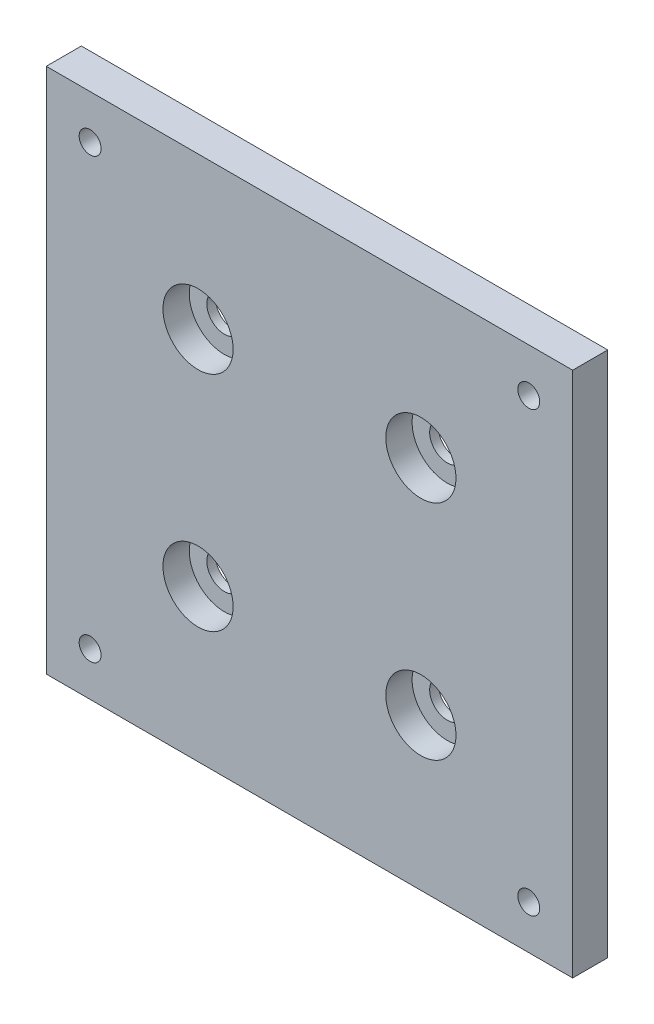
ISO-10303-21;
HEADER;
FILE_DESCRIPTION(('STEP AP214'),'2;1');
FILE_NAME('part.step','',(''),(''),'','','');
FILE_SCHEMA(('AUTOMOTIVE_DESIGN { 1 0 10303 214 1 1 1 1 }'));
ENDSEC;
DATA;
#1=APPLICATION_CONTEXT('core data for automotive mechanical design processes');
#2=APPLICATION_PROTOCOL_DEFINITION('international standard','automotive_design',2000,#1);
#3=PRODUCT_CONTEXT('',#1,'mechanical');
#4=PRODUCT('Part','Part','',(#3));
#5=PRODUCT_RELATED_PRODUCT_CATEGORY('part','',(#4));
#6=PRODUCT_DEFINITION_FORMATION('','',#4);
#7=PRODUCT_DEFINITION_CONTEXT('part definition',#1,'design');
#8=PRODUCT_DEFINITION('design','',#6,#7);
#9=PRODUCT_DEFINITION_SHAPE('','',#8);
#10=(LENGTH_UNIT() NAMED_UNIT(*) SI_UNIT(.MILLI.,.METRE.));
#11=(NAMED_UNIT(*) PLANE_ANGLE_UNIT() SI_UNIT($,.RADIAN.));
#12=(NAMED_UNIT(*) SI_UNIT($,.STERADIAN.) SOLID_ANGLE_UNIT());
#13=UNCERTAINTY_MEASURE_WITH_UNIT(LENGTH_MEASURE(1.E-05),#10,'distance_accuracy_value','');
#14=(GEOMETRIC_REPRESENTATION_CONTEXT(3) GLOBAL_UNCERTAINTY_ASSIGNED_CONTEXT((#13)) GLOBAL_UNIT_ASSIGNED_CONTEXT((#10,
#11,#12)) REPRESENTATION_CONTEXT('',''));
#15=CARTESIAN_POINT('',(0.,0.,0.));
#16=DIRECTION('',(0.,0.,1.));
#17=DIRECTION('',(1.,0.,0.));
#18=AXIS2_PLACEMENT_3D('',#15,#16,#17);
#19=CARTESIAN_POINT('',(30.,30.,4.));
#20=DIRECTION('',(-1.,0.,0.));
#21=DIRECTION('',(0.,0.,1.));
#22=AXIS2_PLACEMENT_3D('',#19,#20,#21);
#23=PLANE('',#22);
#24=DIRECTION('',(0.,1.,0.));
#25=VECTOR('',#24,1.);
#26=CARTESIAN_POINT('',(30.,30.,0.));
#27=LINE('',#26,#25);
#28=CARTESIAN_POINT('',(30.,-30.,0.));
#29=VERTEX_POINT('',#28);
#30=CARTESIAN_POINT('',(30.,30.,0.));
#31=VERTEX_POINT('',#30);
#32=EDGE_CURVE('E109',#29,#31,#27,.T.);
#33=ORIENTED_EDGE('',*,*,#32,.T.);
#34=DIRECTION('',(0.,0.,-1.));
#35=VECTOR('',#34,1.);
#36=CARTESIAN_POINT('',(30.,30.,4.));
#37=LINE('',#36,#35);
#38=CARTESIAN_POINT('',(30.,30.,4.));
#39=VERTEX_POINT('',#38);
#40=EDGE_CURVE('E11',#39,#31,#37,.T.);
#41=ORIENTED_EDGE('',*,*,#40,.F.);
#42=DIRECTION('',(0.,1.,0.));
#43=VECTOR('',#42,1.);
#44=CARTESIAN_POINT('',(30.,30.,4.));
#45=LINE('',#44,#43);
#46=CARTESIAN_POINT('',(30.,-30.,4.));
#47=VERTEX_POINT('',#46);
#48=EDGE_CURVE('E93',#47,#39,#45,.T.);
#49=ORIENTED_EDGE('',*,*,#48,.F.);
#50=DIRECTION('',(0.,0.,-1.));
#51=VECTOR('',#50,1.);
#52=CARTESIAN_POINT('',(30.,-30.,4.));
#53=LINE('',#52,#51);
#54=EDGE_CURVE('E105',#47,#29,#53,.T.);
#55=ORIENTED_EDGE('',*,*,#54,.T.);
#56=EDGE_LOOP('',(#33,#41,#49,#55));
#57=FACE_BOUND('',#56,.T.);
#58=ADVANCED_FACE('F41',(#57),#23,.F.);
#59=CARTESIAN_POINT('',(-30.,30.,4.));
#60=DIRECTION('',(0.,-1.,0.));
#61=DIRECTION('',(0.,0.,-1.));
#62=AXIS2_PLACEMENT_3D('',#59,#60,#61);
#63=PLANE('',#62);
#64=DIRECTION('',(-1.,0.,0.));
#65=VECTOR('',#64,1.);
#66=CARTESIAN_POINT('',(-30.,30.,0.));
#67=LINE('',#66,#65);
#68=CARTESIAN_POINT('',(-30.,30.,0.));
#69=VERTEX_POINT('',#68);
#70=EDGE_CURVE('E98',#31,#69,#67,.T.);
#71=ORIENTED_EDGE('',*,*,#70,.T.);
#72=DIRECTION('',(0.,0.,-1.));
#73=VECTOR('',#72,1.);
#74=CARTESIAN_POINT('',(-30.,30.,4.));
#75=LINE('',#74,#73);
#76=CARTESIAN_POINT('',(-30.,30.,4.));
#77=VERTEX_POINT('',#76);
#78=EDGE_CURVE('E50',#77,#69,#75,.T.);
#79=ORIENTED_EDGE('',*,*,#78,.F.);
#80=DIRECTION('',(-1.,0.,0.));
#81=VECTOR('',#80,1.);
#82=CARTESIAN_POINT('',(-30.,30.,4.));
#83=LINE('',#82,#81);
#84=EDGE_CURVE('E88',#39,#77,#83,.T.);
#85=ORIENTED_EDGE('',*,*,#84,.F.);
#86=ORIENTED_EDGE('',*,*,#40,.T.);
#87=EDGE_LOOP('',(#71,#79,#85,#86));
#88=FACE_BOUND('',#87,.T.);
#89=ADVANCED_FACE('F97',(#88),#63,.F.);
#90=CARTESIAN_POINT('',(-30.,30.,4.));
#91=DIRECTION('',(1.,0.,0.));
#92=DIRECTION('',(0.,1.,0.));
#93=AXIS2_PLACEMENT_3D('',#90,#91,#92);
#94=PLANE('',#93);
#95=DIRECTION('',(0.,-1.,0.));
#96=VECTOR('',#95,1.);
#97=CARTESIAN_POINT('',(-30.,30.,0.));
#98=LINE('',#97,#96);
#99=CARTESIAN_POINT('',(-30.,-30.,0.));
#100=VERTEX_POINT('',#99);
#101=EDGE_CURVE('E75',#69,#100,#98,.T.);
#102=ORIENTED_EDGE('',*,*,#101,.T.);
#103=DIRECTION('',(0.,0.,-1.));
#104=VECTOR('',#103,1.);
#105=CARTESIAN_POINT('',(-30.,-30.,4.));
#106=LINE('',#105,#104);
#107=CARTESIAN_POINT('',(-30.,-30.,4.));
#108=VERTEX_POINT('',#107);
#109=EDGE_CURVE('E100',#108,#100,#106,.T.);
#110=ORIENTED_EDGE('',*,*,#109,.F.);
#111=DIRECTION('',(0.,-1.,0.));
#112=VECTOR('',#111,1.);
#113=CARTESIAN_POINT('',(-30.,30.,4.));
#114=LINE('',#113,#112);
#115=EDGE_CURVE('E91',#77,#108,#114,.T.);
#116=ORIENTED_EDGE('',*,*,#115,.F.);
#117=ORIENTED_EDGE('',*,*,#78,.T.);
#118=EDGE_LOOP('',(#102,#110,#116,#117));
#119=FACE_BOUND('',#118,.T.);
#120=ADVANCED_FACE('F101',(#119),#94,.F.);
#121=CARTESIAN_POINT('',(-30.,-30.,4.));
#122=DIRECTION('',(0.,1.,0.));
#123=DIRECTION('',(0.,0.,1.));
#124=AXIS2_PLACEMENT_3D('',#121,#122,#123);
#125=PLANE('',#124);
#126=DIRECTION('',(1.,0.,0.));
#127=VECTOR('',#126,1.);
#128=CARTESIAN_POINT('',(-30.,-30.,0.));
#129=LINE('',#128,#127);
#130=EDGE_CURVE('E81',#100,#29,#129,.T.);
#131=ORIENTED_EDGE('',*,*,#130,.T.);
#132=ORIENTED_EDGE('',*,*,#54,.F.);
#133=DIRECTION('',(1.,0.,0.));
#134=VECTOR('',#133,1.);
#135=CARTESIAN_POINT('',(-30.,-30.,4.));
#136=LINE('',#135,#134);
#137=EDGE_CURVE('E58',#108,#47,#136,.T.);
#138=ORIENTED_EDGE('',*,*,#137,.F.);
#139=ORIENTED_EDGE('',*,*,#109,.T.);
#140=EDGE_LOOP('',(#131,#132,#138,#139));
#141=FACE_BOUND('',#140,.T.);
#142=ADVANCED_FACE('F123',(#141),#125,.F.);
#143=CARTESIAN_POINT('',(0.,0.,4.));
#144=DIRECTION('',(0.,0.,1.));
#145=DIRECTION('',(1.,0.,0.));
#146=AXIS2_PLACEMENT_3D('',#143,#144,#145);
#147=PLANE('',#146);
#148=CARTESIAN_POINT('',(-12.7,12.7,4.));
#149=DIRECTION('',(0.,0.,1.));
#150=DIRECTION('',(1.,0.,0.));
#151=AXIS2_PLACEMENT_3D('',#148,#149,#150);
#152=CIRCLE('',#151,4.00000000000001);
#153=CARTESIAN_POINT('',(-8.69999999999999,12.7,4.));
#154=VERTEX_POINT('',#153);
#155=EDGE_CURVE('E221',#154,#154,#152,.T.);
#156=ORIENTED_EDGE('',*,*,#155,.F.);
#157=EDGE_LOOP('',(#156));
#158=FACE_BOUND('',#157,.T.);
#159=CARTESIAN_POINT('',(12.7,12.7,4.));
#160=DIRECTION('',(0.,0.,1.));
#161=DIRECTION('',(1.,0.,0.));
#162=AXIS2_PLACEMENT_3D('',#159,#160,#161);
#163=CIRCLE('',#162,4.00000000000001);
#164=CARTESIAN_POINT('',(16.7,12.7,4.));
#165=VERTEX_POINT('',#164);
#166=EDGE_CURVE('E205',#165,#165,#163,.T.);
#167=ORIENTED_EDGE('',*,*,#166,.F.);
#168=EDGE_LOOP('',(#167));
#169=FACE_BOUND('',#168,.T.);
#170=CARTESIAN_POINT('',(12.7,-12.7,4.));
#171=DIRECTION('',(0.,0.,1.));
#172=DIRECTION('',(1.,0.,0.));
#173=AXIS2_PLACEMENT_3D('',#170,#171,#172);
#174=CIRCLE('',#173,4.00000000000001);
#175=CARTESIAN_POINT('',(16.7,-12.7,4.));
#176=VERTEX_POINT('',#175);
#177=EDGE_CURVE('E189',#176,#176,#174,.T.);
#178=ORIENTED_EDGE('',*,*,#177,.F.);
#179=EDGE_LOOP('',(#178));
#180=FACE_BOUND('',#179,.T.);
#181=CARTESIAN_POINT('',(-12.7,-12.7,4.));
#182=DIRECTION('',(0.,0.,1.));
#183=DIRECTION('',(1.,0.,0.));
#184=AXIS2_PLACEMENT_3D('',#181,#182,#183);
#185=CIRCLE('',#184,4.00000000000001);
#186=CARTESIAN_POINT('',(-8.69999999999999,-12.7,4.));
#187=VERTEX_POINT('',#186);
#188=EDGE_CURVE('E173',#187,#187,#185,.T.);
#189=ORIENTED_EDGE('',*,*,#188,.F.);
#190=EDGE_LOOP('',(#189));
#191=FACE_BOUND('',#190,.T.);
#192=CARTESIAN_POINT('',(-25.,25.,4.));
#193=DIRECTION('',(0.,0.,1.));
#194=DIRECTION('',(1.,0.,0.));
#195=AXIS2_PLACEMENT_3D('',#192,#193,#194);
#196=CIRCLE('',#195,1.24999999999999);
#197=CARTESIAN_POINT('',(-23.75,25.,4.));
#198=VERTEX_POINT('',#197);
#199=EDGE_CURVE('E157',#198,#198,#196,.T.);
#200=ORIENTED_EDGE('',*,*,#199,.F.);
#201=EDGE_LOOP('',(#200));
#202=FACE_BOUND('',#201,.T.);
#203=CARTESIAN_POINT('',(25.,25.,4.));
#204=DIRECTION('',(0.,0.,1.));
#205=DIRECTION('',(1.,0.,0.));
#206=AXIS2_PLACEMENT_3D('',#203,#204,#205);
#207=CIRCLE('',#206,1.24999999999999);
#208=CARTESIAN_POINT('',(26.25,25.,4.));
#209=VERTEX_POINT('',#208);
#210=EDGE_CURVE('E149',#209,#209,#207,.T.);
#211=ORIENTED_EDGE('',*,*,#210,.F.);
#212=EDGE_LOOP('',(#211));
#213=FACE_BOUND('',#212,.T.);
#214=CARTESIAN_POINT('',(25.,-25.,4.));
#215=DIRECTION('',(0.,0.,1.));
#216=DIRECTION('',(1.,0.,0.));
#217=AXIS2_PLACEMENT_3D('',#214,#215,#216);
#218=CIRCLE('',#217,1.24999999999999);
#219=CARTESIAN_POINT('',(26.25,-25.,4.));
#220=VERTEX_POINT('',#219);
#221=EDGE_CURVE('E141',#220,#220,#218,.T.);
#222=ORIENTED_EDGE('',*,*,#221,.F.);
#223=EDGE_LOOP('',(#222));
#224=FACE_BOUND('',#223,.T.);
#225=CARTESIAN_POINT('',(-25.,-25.,4.));
#226=DIRECTION('',(0.,0.,1.));
#227=DIRECTION('',(1.,0.,0.));
#228=AXIS2_PLACEMENT_3D('',#225,#226,#227);
#229=CIRCLE('',#228,1.24999999999999);
#230=CARTESIAN_POINT('',(-23.75,-25.,4.));
#231=VERTEX_POINT('',#230);
#232=EDGE_CURVE('E133',#231,#231,#229,.T.);
#233=ORIENTED_EDGE('',*,*,#232,.F.);
#234=EDGE_LOOP('',(#233));
#235=FACE_BOUND('',#234,.T.);
#236=ORIENTED_EDGE('',*,*,#48,.T.);
#237=ORIENTED_EDGE('',*,*,#84,.T.);
#238=ORIENTED_EDGE('',*,*,#115,.T.);
#239=ORIENTED_EDGE('',*,*,#137,.T.);
#240=EDGE_LOOP('',(#236,#237,#238,#239));
#241=FACE_BOUND('',#240,.T.);
#242=ADVANCED_FACE('F89',(#158,#169,#180,#191,#202,#213,#224,#235,#241),#147,.T.);
#243=CARTESIAN_POINT('',(0.,0.,0.));
#244=DIRECTION('',(0.,0.,1.));
#245=DIRECTION('',(1.,0.,0.));
#246=AXIS2_PLACEMENT_3D('',#243,#244,#245);
#247=PLANE('',#246);
#248=CARTESIAN_POINT('',(-12.7,12.7,0.));
#249=DIRECTION('',(0.,0.,1.));
#250=DIRECTION('',(1.,0.,0.));
#251=AXIS2_PLACEMENT_3D('',#248,#249,#250);
#252=CIRCLE('',#251,2.00000000000001);
#253=CARTESIAN_POINT('',(-10.7,12.7,0.));
#254=VERTEX_POINT('',#253);
#255=EDGE_CURVE('E209',#254,#254,#252,.T.);
#256=ORIENTED_EDGE('',*,*,#255,.T.);
#257=EDGE_LOOP('',(#256));
#258=FACE_BOUND('',#257,.T.);
#259=CARTESIAN_POINT('',(12.7,12.7,0.));
#260=DIRECTION('',(0.,0.,1.));
#261=DIRECTION('',(1.,0.,0.));
#262=AXIS2_PLACEMENT_3D('',#259,#260,#261);
#263=CIRCLE('',#262,2.00000000000001);
#264=CARTESIAN_POINT('',(14.7,12.7,0.));
#265=VERTEX_POINT('',#264);
#266=EDGE_CURVE('E193',#265,#265,#263,.T.);
#267=ORIENTED_EDGE('',*,*,#266,.T.);
#268=EDGE_LOOP('',(#267));
#269=FACE_BOUND('',#268,.T.);
#270=CARTESIAN_POINT('',(12.7,-12.7,0.));
#271=DIRECTION('',(0.,0.,1.));
#272=DIRECTION('',(1.,0.,0.));
#273=AXIS2_PLACEMENT_3D('',#270,#271,#272);
#274=CIRCLE('',#273,2.00000000000001);
#275=CARTESIAN_POINT('',(14.7,-12.7,0.));
#276=VERTEX_POINT('',#275);
#277=EDGE_CURVE('E177',#276,#276,#274,.T.);
#278=ORIENTED_EDGE('',*,*,#277,.T.);
#279=EDGE_LOOP('',(#278));
#280=FACE_BOUND('',#279,.T.);
#281=CARTESIAN_POINT('',(-12.7,-12.7,0.));
#282=DIRECTION('',(0.,0.,1.));
#283=DIRECTION('',(1.,0.,0.));
#284=AXIS2_PLACEMENT_3D('',#281,#282,#283);
#285=CIRCLE('',#284,2.00000000000001);
#286=CARTESIAN_POINT('',(-10.7,-12.7,0.));
#287=VERTEX_POINT('',#286);
#288=EDGE_CURVE('E161',#287,#287,#285,.T.);
#289=ORIENTED_EDGE('',*,*,#288,.T.);
#290=EDGE_LOOP('',(#289));
#291=FACE_BOUND('',#290,.T.);
#292=CARTESIAN_POINT('',(-25.,25.,0.));
#293=DIRECTION('',(0.,0.,1.));
#294=DIRECTION('',(1.,0.,0.));
#295=AXIS2_PLACEMENT_3D('',#292,#293,#294);
#296=CIRCLE('',#295,1.25);
#297=CARTESIAN_POINT('',(-23.75,25.,0.));
#298=VERTEX_POINT('',#297);
#299=EDGE_CURVE('E153',#298,#298,#296,.T.);
#300=ORIENTED_EDGE('',*,*,#299,.T.);
#301=EDGE_LOOP('',(#300));
#302=FACE_BOUND('',#301,.T.);
#303=CARTESIAN_POINT('',(25.,25.,0.));
#304=DIRECTION('',(0.,0.,1.));
#305=DIRECTION('',(1.,0.,0.));
#306=AXIS2_PLACEMENT_3D('',#303,#304,#305);
#307=CIRCLE('',#306,1.25);
#308=CARTESIAN_POINT('',(26.25,25.,0.));
#309=VERTEX_POINT('',#308);
#310=EDGE_CURVE('E145',#309,#309,#307,.T.);
#311=ORIENTED_EDGE('',*,*,#310,.T.);
#312=EDGE_LOOP('',(#311));
#313=FACE_BOUND('',#312,.T.);
#314=CARTESIAN_POINT('',(25.,-25.,0.));
#315=DIRECTION('',(0.,0.,1.));
#316=DIRECTION('',(1.,0.,0.));
#317=AXIS2_PLACEMENT_3D('',#314,#315,#316);
#318=CIRCLE('',#317,1.25);
#319=CARTESIAN_POINT('',(26.25,-25.,0.));
#320=VERTEX_POINT('',#319);
#321=EDGE_CURVE('E137',#320,#320,#318,.T.);
#322=ORIENTED_EDGE('',*,*,#321,.T.);
#323=EDGE_LOOP('',(#322));
#324=FACE_BOUND('',#323,.T.);
#325=CARTESIAN_POINT('',(-25.,-25.,0.));
#326=DIRECTION('',(0.,0.,1.));
#327=DIRECTION('',(1.,0.,0.));
#328=AXIS2_PLACEMENT_3D('',#325,#326,#327);
#329=CIRCLE('',#328,1.25);
#330=CARTESIAN_POINT('',(-23.75,-25.,0.));
#331=VERTEX_POINT('',#330);
#332=EDGE_CURVE('E113',#331,#331,#329,.T.);
#333=ORIENTED_EDGE('',*,*,#332,.T.);
#334=EDGE_LOOP('',(#333));
#335=FACE_BOUND('',#334,.T.);
#336=ORIENTED_EDGE('',*,*,#32,.F.);
#337=ORIENTED_EDGE('',*,*,#130,.F.);
#338=ORIENTED_EDGE('',*,*,#101,.F.);
#339=ORIENTED_EDGE('',*,*,#70,.F.);
#340=EDGE_LOOP('',(#336,#337,#338,#339));
#341=FACE_BOUND('',#340,.T.);
#342=ADVANCED_FACE('F126',(#258,#269,#280,#291,#302,#313,#324,#335,#341),#247,.F.);
#343=CARTESIAN_POINT('',(-25.,-25.,4.));
#344=DIRECTION('',(0.,0.,1.));
#345=DIRECTION('',(1.,0.,0.));
#346=AXIS2_PLACEMENT_3D('',#343,#344,#345);
#347=CYLINDRICAL_SURFACE('',#346,1.24999999999999);
#348=ORIENTED_EDGE('',*,*,#332,.F.);
#349=EDGE_LOOP('',(#348));
#350=FACE_BOUND('',#349,.T.);
#351=ORIENTED_EDGE('',*,*,#232,.T.);
#352=EDGE_LOOP('',(#351));
#353=FACE_BOUND('',#352,.T.);
#354=ADVANCED_FACE('F245',(#350,#353),#347,.F.);
#355=CARTESIAN_POINT('',(25.,-25.,4.));
#356=DIRECTION('',(0.,0.,1.));
#357=DIRECTION('',(1.,0.,0.));
#358=AXIS2_PLACEMENT_3D('',#355,#356,#357);
#359=CYLINDRICAL_SURFACE('',#358,1.24999999999999);
#360=ORIENTED_EDGE('',*,*,#321,.F.);
#361=EDGE_LOOP('',(#360));
#362=FACE_BOUND('',#361,.T.);
#363=ORIENTED_EDGE('',*,*,#221,.T.);
#364=EDGE_LOOP('',(#363));
#365=FACE_BOUND('',#364,.T.);
#366=ADVANCED_FACE('F247',(#362,#365),#359,.F.);
#367=CARTESIAN_POINT('',(25.,25.,4.));
#368=DIRECTION('',(0.,0.,1.));
#369=DIRECTION('',(1.,0.,0.));
#370=AXIS2_PLACEMENT_3D('',#367,#368,#369);
#371=CYLINDRICAL_SURFACE('',#370,1.24999999999999);
#372=ORIENTED_EDGE('',*,*,#310,.F.);
#373=EDGE_LOOP('',(#372));
#374=FACE_BOUND('',#373,.T.);
#375=ORIENTED_EDGE('',*,*,#210,.T.);
#376=EDGE_LOOP('',(#375));
#377=FACE_BOUND('',#376,.T.);
#378=ADVANCED_FACE('F254',(#374,#377),#371,.F.);
#379=CARTESIAN_POINT('',(-25.,25.,4.));
#380=DIRECTION('',(0.,0.,1.));
#381=DIRECTION('',(1.,0.,0.));
#382=AXIS2_PLACEMENT_3D('',#379,#380,#381);
#383=CYLINDRICAL_SURFACE('',#382,1.24999999999999);
#384=ORIENTED_EDGE('',*,*,#299,.F.);
#385=EDGE_LOOP('',(#384));
#386=FACE_BOUND('',#385,.T.);
#387=ORIENTED_EDGE('',*,*,#199,.T.);
#388=EDGE_LOOP('',(#387));
#389=FACE_BOUND('',#388,.T.);
#390=ADVANCED_FACE('F296',(#386,#389),#383,.F.);
#391=CARTESIAN_POINT('',(-12.7,-12.7,4.));
#392=DIRECTION('',(0.,0.,1.));
#393=DIRECTION('',(1.,0.,0.));
#394=AXIS2_PLACEMENT_3D('',#391,#392,#393);
#395=CYLINDRICAL_SURFACE('',#394,2.00000000000001);
#396=ORIENTED_EDGE('',*,*,#288,.F.);
#397=EDGE_LOOP('',(#396));
#398=FACE_BOUND('',#397,.T.);
#399=CARTESIAN_POINT('',(-12.7,-12.7,1.));
#400=DIRECTION('',(0.,0.,1.));
#401=DIRECTION('',(1.,0.,0.));
#402=AXIS2_PLACEMENT_3D('',#399,#400,#401);
#403=CIRCLE('',#402,2.00000000000001);
#404=CARTESIAN_POINT('',(-10.7,-12.7,1.));
#405=VERTEX_POINT('',#404);
#406=EDGE_CURVE('E165',#405,#405,#403,.T.);
#407=ORIENTED_EDGE('',*,*,#406,.T.);
#408=EDGE_LOOP('',(#407));
#409=FACE_BOUND('',#408,.T.);
#410=ADVANCED_FACE('F290',(#398,#409),#395,.F.);
#411=CARTESIAN_POINT('',(-10.7,-12.7,1.));
#412=DIRECTION('',(0.,0.,-1.));
#413=DIRECTION('',(-1.,0.,0.));
#414=AXIS2_PLACEMENT_3D('',#411,#412,#413);
#415=PLANE('',#414);
#416=ORIENTED_EDGE('',*,*,#406,.F.);
#417=EDGE_LOOP('',(#416));
#418=FACE_BOUND('',#417,.T.);
#419=CARTESIAN_POINT('',(-12.7,-12.7,1.));
#420=DIRECTION('',(0.,0.,1.));
#421=DIRECTION('',(1.,0.,0.));
#422=AXIS2_PLACEMENT_3D('',#419,#420,#421);
#423=CIRCLE('',#422,4.00000000000001);
#424=CARTESIAN_POINT('',(-8.69999999999999,-12.7,1.));
#425=VERTEX_POINT('',#424);
#426=EDGE_CURVE('E169',#425,#425,#423,.T.);
#427=ORIENTED_EDGE('',*,*,#426,.T.);
#428=EDGE_LOOP('',(#427));
#429=FACE_BOUND('',#428,.T.);
#430=ADVANCED_FACE('F295',(#418,#429),#415,.F.);
#431=CARTESIAN_POINT('',(-12.7,-12.7,4.));
#432=DIRECTION('',(0.,0.,1.));
#433=DIRECTION('',(1.,0.,0.));
#434=AXIS2_PLACEMENT_3D('',#431,#432,#433);
#435=CYLINDRICAL_SURFACE('',#434,4.00000000000001);
#436=ORIENTED_EDGE('',*,*,#426,.F.);
#437=EDGE_LOOP('',(#436));
#438=FACE_BOUND('',#437,.T.);
#439=ORIENTED_EDGE('',*,*,#188,.T.);
#440=EDGE_LOOP('',(#439));
#441=FACE_BOUND('',#440,.T.);
#442=ADVANCED_FACE('F308',(#438,#441),#435,.F.);
#443=CARTESIAN_POINT('',(12.7,-12.7,4.));
#444=DIRECTION('',(0.,0.,1.));
#445=DIRECTION('',(1.,0.,0.));
#446=AXIS2_PLACEMENT_3D('',#443,#444,#445);
#447=CYLINDRICAL_SURFACE('',#446,2.00000000000001);
#448=ORIENTED_EDGE('',*,*,#277,.F.);
#449=EDGE_LOOP('',(#448));
#450=FACE_BOUND('',#449,.T.);
#451=CARTESIAN_POINT('',(12.7,-12.7,1.));
#452=DIRECTION('',(0.,0.,1.));
#453=DIRECTION('',(1.,0.,0.));
#454=AXIS2_PLACEMENT_3D('',#451,#452,#453);
#455=CIRCLE('',#454,2.00000000000001);
#456=CARTESIAN_POINT('',(14.7,-12.7,1.));
#457=VERTEX_POINT('',#456);
#458=EDGE_CURVE('E181',#457,#457,#455,.T.);
#459=ORIENTED_EDGE('',*,*,#458,.T.);
#460=EDGE_LOOP('',(#459));
#461=FACE_BOUND('',#460,.T.);
#462=ADVANCED_FACE('F318',(#450,#461),#447,.F.);
#463=CARTESIAN_POINT('',(14.7,-12.7,1.));
#464=DIRECTION('',(0.,0.,-1.));
#465=DIRECTION('',(-1.,0.,0.));
#466=AXIS2_PLACEMENT_3D('',#463,#464,#465);
#467=PLANE('',#466);
#468=ORIENTED_EDGE('',*,*,#458,.F.);
#469=EDGE_LOOP('',(#468));
#470=FACE_BOUND('',#469,.T.);
#471=CARTESIAN_POINT('',(12.7,-12.7,1.));
#472=DIRECTION('',(0.,0.,1.));
#473=DIRECTION('',(1.,0.,0.));
#474=AXIS2_PLACEMENT_3D('',#471,#472,#473);
#475=CIRCLE('',#474,4.00000000000001);
#476=CARTESIAN_POINT('',(16.7,-12.7,1.));
#477=VERTEX_POINT('',#476);
#478=EDGE_CURVE('E185',#477,#477,#475,.T.);
#479=ORIENTED_EDGE('',*,*,#478,.T.);
#480=EDGE_LOOP('',(#479));
#481=FACE_BOUND('',#480,.T.);
#482=ADVANCED_FACE('F328',(#470,#481),#467,.F.);
#483=CARTESIAN_POINT('',(12.7,-12.7,4.));
#484=DIRECTION('',(0.,0.,1.));
#485=DIRECTION('',(1.,0.,0.));
#486=AXIS2_PLACEMENT_3D('',#483,#484,#485);
#487=CYLINDRICAL_SURFACE('',#486,4.00000000000001);
#488=ORIENTED_EDGE('',*,*,#478,.F.);
#489=EDGE_LOOP('',(#488));
#490=FACE_BOUND('',#489,.T.);
#491=ORIENTED_EDGE('',*,*,#177,.T.);
#492=EDGE_LOOP('',(#491));
#493=FACE_BOUND('',#492,.T.);
#494=ADVANCED_FACE('F338',(#490,#493),#487,.F.);
#495=CARTESIAN_POINT('',(12.7,12.7,4.));
#496=DIRECTION('',(0.,0.,1.));
#497=DIRECTION('',(1.,0.,0.));
#498=AXIS2_PLACEMENT_3D('',#495,#496,#497);
#499=CYLINDRICAL_SURFACE('',#498,2.00000000000001);
#500=ORIENTED_EDGE('',*,*,#266,.F.);
#501=EDGE_LOOP('',(#500));
#502=FACE_BOUND('',#501,.T.);
#503=CARTESIAN_POINT('',(12.7,12.7,1.));
#504=DIRECTION('',(0.,0.,1.));
#505=DIRECTION('',(1.,0.,0.));
#506=AXIS2_PLACEMENT_3D('',#503,#504,#505);
#507=CIRCLE('',#506,2.00000000000001);
#508=CARTESIAN_POINT('',(14.7,12.7,1.));
#509=VERTEX_POINT('',#508);
#510=EDGE_CURVE('E197',#509,#509,#507,.T.);
#511=ORIENTED_EDGE('',*,*,#510,.T.);
#512=EDGE_LOOP('',(#511));
#513=FACE_BOUND('',#512,.T.);
#514=ADVANCED_FACE('F348',(#502,#513),#499,.F.);
#515=CARTESIAN_POINT('',(14.7,12.7,1.));
#516=DIRECTION('',(0.,0.,-1.));
#517=DIRECTION('',(-1.,0.,0.));
#518=AXIS2_PLACEMENT_3D('',#515,#516,#517);
#519=PLANE('',#518);
#520=ORIENTED_EDGE('',*,*,#510,.F.);
#521=EDGE_LOOP('',(#520));
#522=FACE_BOUND('',#521,.T.);
#523=CARTESIAN_POINT('',(12.7,12.7,1.));
#524=DIRECTION('',(0.,0.,1.));
#525=DIRECTION('',(1.,0.,0.));
#526=AXIS2_PLACEMENT_3D('',#523,#524,#525);
#527=CIRCLE('',#526,4.00000000000001);
#528=CARTESIAN_POINT('',(16.7,12.7,1.));
#529=VERTEX_POINT('',#528);
#530=EDGE_CURVE('E201',#529,#529,#527,.T.);
#531=ORIENTED_EDGE('',*,*,#530,.T.);
#532=EDGE_LOOP('',(#531));
#533=FACE_BOUND('',#532,.T.);
#534=ADVANCED_FACE('F358',(#522,#533),#519,.F.);
#535=CARTESIAN_POINT('',(12.7,12.7,4.));
#536=DIRECTION('',(0.,0.,1.));
#537=DIRECTION('',(1.,0.,0.));
#538=AXIS2_PLACEMENT_3D('',#535,#536,#537);
#539=CYLINDRICAL_SURFACE('',#538,4.00000000000001);
#540=ORIENTED_EDGE('',*,*,#530,.F.);
#541=EDGE_LOOP('',(#540));
#542=FACE_BOUND('',#541,.T.);
#543=ORIENTED_EDGE('',*,*,#166,.T.);
#544=EDGE_LOOP('',(#543));
#545=FACE_BOUND('',#544,.T.);
#546=ADVANCED_FACE('F368',(#542,#545),#539,.F.);
#547=CARTESIAN_POINT('',(-12.7,12.7,4.));
#548=DIRECTION('',(0.,0.,1.));
#549=DIRECTION('',(1.,0.,0.));
#550=AXIS2_PLACEMENT_3D('',#547,#548,#549);
#551=CYLINDRICAL_SURFACE('',#550,2.00000000000001);
#552=ORIENTED_EDGE('',*,*,#255,.F.);
#553=EDGE_LOOP('',(#552));
#554=FACE_BOUND('',#553,.T.);
#555=CARTESIAN_POINT('',(-12.7,12.7,1.));
#556=DIRECTION('',(0.,0.,1.));
#557=DIRECTION('',(1.,0.,0.));
#558=AXIS2_PLACEMENT_3D('',#555,#556,#557);
#559=CIRCLE('',#558,2.00000000000001);
#560=CARTESIAN_POINT('',(-10.7,12.7,1.));
#561=VERTEX_POINT('',#560);
#562=EDGE_CURVE('E213',#561,#561,#559,.T.);
#563=ORIENTED_EDGE('',*,*,#562,.T.);
#564=EDGE_LOOP('',(#563));
#565=FACE_BOUND('',#564,.T.);
#566=ADVANCED_FACE('F378',(#554,#565),#551,.F.);
#567=CARTESIAN_POINT('',(-10.7,12.7,1.));
#568=DIRECTION('',(0.,0.,-1.));
#569=DIRECTION('',(-1.,0.,0.));
#570=AXIS2_PLACEMENT_3D('',#567,#568,#569);
#571=PLANE('',#570);
#572=ORIENTED_EDGE('',*,*,#562,.F.);
#573=EDGE_LOOP('',(#572));
#574=FACE_BOUND('',#573,.T.);
#575=CARTESIAN_POINT('',(-12.7,12.7,1.));
#576=DIRECTION('',(0.,0.,1.));
#577=DIRECTION('',(1.,0.,0.));
#578=AXIS2_PLACEMENT_3D('',#575,#576,#577);
#579=CIRCLE('',#578,4.00000000000001);
#580=CARTESIAN_POINT('',(-8.69999999999999,12.7,1.));
#581=VERTEX_POINT('',#580);
#582=EDGE_CURVE('E217',#581,#581,#579,.T.);
#583=ORIENTED_EDGE('',*,*,#582,.T.);
#584=EDGE_LOOP('',(#583));
#585=FACE_BOUND('',#584,.T.);
#586=ADVANCED_FACE('F388',(#574,#585),#571,.F.);
#587=CARTESIAN_POINT('',(-12.7,12.7,4.));
#588=DIRECTION('',(0.,0.,1.));
#589=DIRECTION('',(1.,0.,0.));
#590=AXIS2_PLACEMENT_3D('',#587,#588,#589);
#591=CYLINDRICAL_SURFACE('',#590,4.00000000000001);
#592=ORIENTED_EDGE('',*,*,#582,.F.);
#593=EDGE_LOOP('',(#592));
#594=FACE_BOUND('',#593,.T.);
#595=ORIENTED_EDGE('',*,*,#155,.T.);
#596=EDGE_LOOP('',(#595));
#597=FACE_BOUND('',#596,.T.);
#598=ADVANCED_FACE('F226',(#594,#597),#591,.F.);
#599=CLOSED_SHELL('',(#58,#89,#120,#142,#242,#342,#354,#366,#378,#390,#410,#430,#442,#462,#482,
#494,#514,#534,#546,#566,#586,#598));
#600=MANIFOLD_SOLID_BREP('B2',#599);
#601=ADVANCED_BREP_SHAPE_REPRESENTATION('',(#18,#600),#14);
#602=SHAPE_DEFINITION_REPRESENTATION(#9,#601);
ENDSEC;
END-ISO-10303-21;
